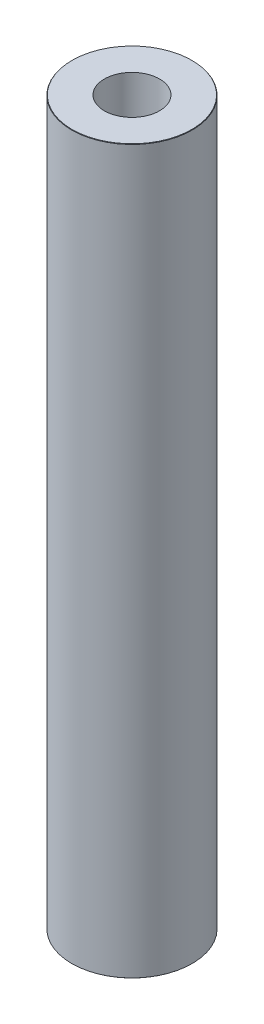
ISO-10303-21;
HEADER;
FILE_DESCRIPTION(('STEP AP214'),'2;1');
FILE_NAME('part.step','',(''),(''),'','','');
FILE_SCHEMA(('AUTOMOTIVE_DESIGN { 1 0 10303 214 1 1 1 1 }'));
ENDSEC;
DATA;
#1=APPLICATION_CONTEXT('core data for automotive mechanical design processes');
#2=APPLICATION_PROTOCOL_DEFINITION('international standard','automotive_design',2000,#1);
#3=PRODUCT_CONTEXT('',#1,'mechanical');
#4=PRODUCT('Part','Part','',(#3));
#5=PRODUCT_RELATED_PRODUCT_CATEGORY('part','',(#4));
#6=PRODUCT_DEFINITION_FORMATION('','',#4);
#7=PRODUCT_DEFINITION_CONTEXT('part definition',#1,'design');
#8=PRODUCT_DEFINITION('design','',#6,#7);
#9=PRODUCT_DEFINITION_SHAPE('','',#8);
#10=(LENGTH_UNIT() NAMED_UNIT(*) SI_UNIT(.MILLI.,.METRE.));
#11=(NAMED_UNIT(*) PLANE_ANGLE_UNIT() SI_UNIT($,.RADIAN.));
#12=(NAMED_UNIT(*) SI_UNIT($,.STERADIAN.) SOLID_ANGLE_UNIT());
#13=UNCERTAINTY_MEASURE_WITH_UNIT(LENGTH_MEASURE(1.E-05),#10,'distance_accuracy_value','');
#14=(GEOMETRIC_REPRESENTATION_CONTEXT(3) GLOBAL_UNCERTAINTY_ASSIGNED_CONTEXT((#13)) GLOBAL_UNIT_ASSIGNED_CONTEXT((#10,
#11,#12)) REPRESENTATION_CONTEXT('',''));
#15=CARTESIAN_POINT('',(0.,0.,0.));
#16=DIRECTION('',(0.,0.,1.));
#17=DIRECTION('',(1.,0.,0.));
#18=AXIS2_PLACEMENT_3D('',#15,#16,#17);
#19=CARTESIAN_POINT('',(0.,600.,0.));
#20=DIRECTION('',(0.,-1.,0.));
#21=DIRECTION('',(0.,0.,-1.));
#22=AXIS2_PLACEMENT_3D('',#19,#20,#21);
#23=CYLINDRICAL_SURFACE('',#22,50.);
#24=CARTESIAN_POINT('',(0.,599.672750332414,0.));
#25=DIRECTION('',(0.,1.,0.));
#26=DIRECTION('',(0.,0.,1.));
#27=AXIS2_PLACEMENT_3D('',#24,#25,#26);
#28=CIRCLE('',#27,50.);
#29=CARTESIAN_POINT('',(0.,599.672750332414,50.));
#30=VERTEX_POINT('',#29);
#31=EDGE_CURVE('E50',#30,#30,#28,.F.);
#32=ORIENTED_EDGE('',*,*,#31,.T.);
#33=EDGE_LOOP('',(#32));
#34=FACE_BOUND('',#33,.T.);
#35=CARTESIAN_POINT('',(0.,0.272560170768044,0.));
#36=DIRECTION('',(0.,1.,0.));
#37=DIRECTION('',(0.,0.,1.));
#38=AXIS2_PLACEMENT_3D('',#35,#36,#37);
#39=CIRCLE('',#38,50.);
#40=CARTESIAN_POINT('',(0.,0.272560170768044,50.));
#41=VERTEX_POINT('',#40);
#42=EDGE_CURVE('E51',#41,#41,#39,.T.);
#43=ORIENTED_EDGE('',*,*,#42,.T.);
#44=EDGE_LOOP('',(#43));
#45=FACE_BOUND('',#44,.T.);
#46=ADVANCED_FACE('F39',(#34,#45),#23,.T.);
#47=CARTESIAN_POINT('',(0.,600.,0.));
#48=DIRECTION('',(0.,1.,0.));
#49=DIRECTION('',(0.,0.,1.));
#50=AXIS2_PLACEMENT_3D('',#47,#48,#49);
#51=PLANE('',#50);
#52=CARTESIAN_POINT('',(0.,600.,0.));
#53=DIRECTION('',(0.,1.,0.));
#54=DIRECTION('',(0.,0.,1.));
#55=AXIS2_PLACEMENT_3D('',#52,#53,#54);
#56=CIRCLE('',#55,49.7274398292319);
#57=CARTESIAN_POINT('',(0.,600.,49.7274398292319));
#58=VERTEX_POINT('',#57);
#59=EDGE_CURVE('E54',#58,#58,#56,.T.);
#60=ORIENTED_EDGE('',*,*,#59,.T.);
#61=EDGE_LOOP('',(#60));
#62=FACE_BOUND('',#61,.T.);
#63=CARTESIAN_POINT('',(0.,600.,0.));
#64=DIRECTION('',(0.,1.,0.));
#65=DIRECTION('',(0.,0.,1.));
#66=AXIS2_PLACEMENT_3D('',#63,#64,#65);
#67=CIRCLE('',#66,22.9211248382146);
#68=CARTESIAN_POINT('',(0.,600.,22.9211248382146));
#69=VERTEX_POINT('',#68);
#70=EDGE_CURVE('E58',#69,#69,#67,.T.);
#71=ORIENTED_EDGE('',*,*,#70,.F.);
#72=EDGE_LOOP('',(#71));
#73=FACE_BOUND('',#72,.T.);
#74=ADVANCED_FACE('F69',(#62,#73),#51,.T.);
#75=CARTESIAN_POINT('',(0.,0.,0.));
#76=DIRECTION('',(0.,1.,0.));
#77=DIRECTION('',(0.,0.,1.));
#78=AXIS2_PLACEMENT_3D('',#75,#76,#77);
#79=PLANE('',#78);
#80=CARTESIAN_POINT('',(0.,0.,0.));
#81=DIRECTION('',(0.,1.,0.));
#82=DIRECTION('',(0.,0.,1.));
#83=AXIS2_PLACEMENT_3D('',#80,#81,#82);
#84=CIRCLE('',#83,49.6727503324145);
#85=CARTESIAN_POINT('',(0.,0.,49.6727503324145));
#86=VERTEX_POINT('',#85);
#87=EDGE_CURVE('E10',#86,#86,#84,.F.);
#88=ORIENTED_EDGE('',*,*,#87,.T.);
#89=EDGE_LOOP('',(#88));
#90=FACE_BOUND('',#89,.T.);
#91=CARTESIAN_POINT('',(0.,0.,0.));
#92=DIRECTION('',(0.,1.,0.));
#93=DIRECTION('',(0.,0.,1.));
#94=AXIS2_PLACEMENT_3D('',#91,#92,#93);
#95=CIRCLE('',#94,22.9211248382146);
#96=CARTESIAN_POINT('',(0.,0.,22.9211248382146));
#97=VERTEX_POINT('',#96);
#98=EDGE_CURVE('E63',#97,#97,#95,.T.);
#99=ORIENTED_EDGE('',*,*,#98,.T.);
#100=EDGE_LOOP('',(#99));
#101=FACE_BOUND('',#100,.T.);
#102=ADVANCED_FACE('F75',(#90,#101),#79,.F.);
#103=CARTESIAN_POINT('',(0.,600.,0.));
#104=DIRECTION('',(0.,-1.,0.));
#105=DIRECTION('',(0.,0.,-1.));
#106=AXIS2_PLACEMENT_3D('',#103,#104,#105);
#107=CYLINDRICAL_SURFACE('',#106,22.9211248382146);
#108=ORIENTED_EDGE('',*,*,#70,.T.);
#109=EDGE_LOOP('',(#108));
#110=FACE_BOUND('',#109,.T.);
#111=ORIENTED_EDGE('',*,*,#98,.F.);
#112=EDGE_LOOP('',(#111));
#113=FACE_BOUND('',#112,.T.);
#114=ADVANCED_FACE('F70',(#110,#113),#107,.F.);
#115=CARTESIAN_POINT('',(0.,600.,0.));
#116=DIRECTION('',(0.,-1.,0.));
#117=DIRECTION('',(0.,0.,-1.));
#118=AXIS2_PLACEMENT_3D('',#115,#116,#117);
#119=CONICAL_SURFACE('',#118,49.7274398292319,0.694471519258996);
#120=ORIENTED_EDGE('',*,*,#31,.F.);
#121=EDGE_LOOP('',(#120));
#122=FACE_BOUND('',#121,.T.);
#123=ORIENTED_EDGE('',*,*,#59,.F.);
#124=EDGE_LOOP('',(#123));
#125=FACE_BOUND('',#124,.T.);
#126=ADVANCED_FACE('F81',(#122,#125),#119,.T.);
#127=CARTESIAN_POINT('',(0.,0.272560170768044,0.));
#128=DIRECTION('',(0.,1.,0.));
#129=DIRECTION('',(0.,0.,1.));
#130=AXIS2_PLACEMENT_3D('',#127,#128,#129);
#131=CONICAL_SURFACE('',#130,50.,0.876324807536034);
#132=ORIENTED_EDGE('',*,*,#87,.F.);
#133=EDGE_LOOP('',(#132));
#134=FACE_BOUND('',#133,.T.);
#135=ORIENTED_EDGE('',*,*,#42,.F.);
#136=EDGE_LOOP('',(#135));
#137=FACE_BOUND('',#136,.T.);
#138=ADVANCED_FACE('F45',(#134,#137),#131,.T.);
#139=CLOSED_SHELL('',(#46,#74,#102,#114,#126,#138));
#140=MANIFOLD_SOLID_BREP('B2',#139);
#141=ADVANCED_BREP_SHAPE_REPRESENTATION('',(#18,#140),#14);
#142=SHAPE_DEFINITION_REPRESENTATION(#9,#141);
ENDSEC;
END-ISO-10303-21;
